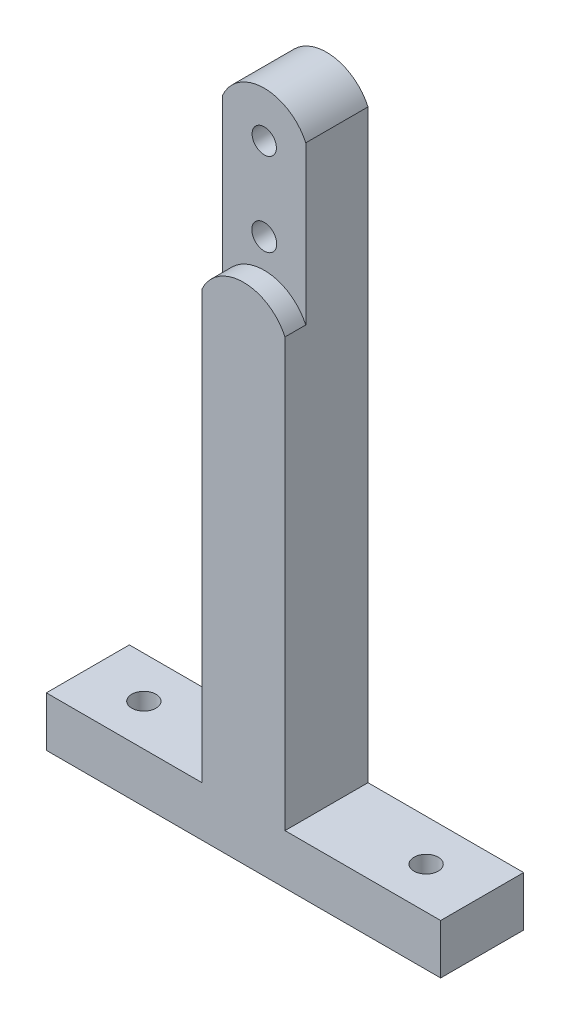
ISO-10303-21;
HEADER;
FILE_DESCRIPTION(('STEP AP214'),'2;1');
FILE_NAME('part.step','',(''),(''),'','','');
FILE_SCHEMA(('AUTOMOTIVE_DESIGN { 1 0 10303 214 1 1 1 1 }'));
ENDSEC;
DATA;
#1=APPLICATION_CONTEXT('core data for automotive mechanical design processes');
#2=APPLICATION_PROTOCOL_DEFINITION('international standard','automotive_design',2000,#1);
#3=PRODUCT_CONTEXT('',#1,'mechanical');
#4=PRODUCT('Part','Part','',(#3));
#5=PRODUCT_RELATED_PRODUCT_CATEGORY('part','',(#4));
#6=PRODUCT_DEFINITION_FORMATION('','',#4);
#7=PRODUCT_DEFINITION_CONTEXT('part definition',#1,'design');
#8=PRODUCT_DEFINITION('design','',#6,#7);
#9=PRODUCT_DEFINITION_SHAPE('','',#8);
#10=(LENGTH_UNIT() NAMED_UNIT(*) SI_UNIT(.MILLI.,.METRE.));
#11=(NAMED_UNIT(*) PLANE_ANGLE_UNIT() SI_UNIT($,.RADIAN.));
#12=(NAMED_UNIT(*) SI_UNIT($,.STERADIAN.) SOLID_ANGLE_UNIT());
#13=UNCERTAINTY_MEASURE_WITH_UNIT(LENGTH_MEASURE(1.E-05),#10,'distance_accuracy_value','');
#14=(GEOMETRIC_REPRESENTATION_CONTEXT(3) GLOBAL_UNCERTAINTY_ASSIGNED_CONTEXT((#13)) GLOBAL_UNIT_ASSIGNED_CONTEXT((#10,
#11,#12)) REPRESENTATION_CONTEXT('',''));
#15=CARTESIAN_POINT('',(0.,0.,0.));
#16=DIRECTION('',(0.,0.,1.));
#17=DIRECTION('',(1.,0.,0.));
#18=AXIS2_PLACEMENT_3D('',#15,#16,#17);
#19=CARTESIAN_POINT('',(0.,-132.83,20.));
#20=DIRECTION('',(0.,0.,-1.));
#21=DIRECTION('',(-1.,0.,0.));
#22=AXIS2_PLACEMENT_3D('',#19,#20,#21);
#23=CYLINDRICAL_SURFACE('',#22,11.);
#24=CARTESIAN_POINT('',(0.,-132.83,15.));
#25=DIRECTION('',(0.,0.,1.));
#26=DIRECTION('',(1.,0.,0.));
#27=AXIS2_PLACEMENT_3D('',#24,#25,#26);
#28=CIRCLE('',#27,11.);
#29=CARTESIAN_POINT('',(10.,-128.247424305044,15.));
#30=VERTEX_POINT('',#29);
#31=CARTESIAN_POINT('',(-10.,-128.247424305044,15.));
#32=VERTEX_POINT('',#31);
#33=EDGE_CURVE('E202',#30,#32,#28,.T.);
#34=ORIENTED_EDGE('',*,*,#33,.F.);
#35=DIRECTION('',(0.,0.,-1.));
#36=VECTOR('',#35,1.);
#37=CARTESIAN_POINT('',(10.,-128.247424305044,20.));
#38=LINE('',#37,#36);
#39=CARTESIAN_POINT('',(10.,-128.247424305044,0.));
#40=VERTEX_POINT('',#39);
#41=EDGE_CURVE('E91',#30,#40,#38,.T.);
#42=ORIENTED_EDGE('',*,*,#41,.T.);
#43=CARTESIAN_POINT('',(0.,-132.83,0.));
#44=DIRECTION('',(0.,0.,1.));
#45=DIRECTION('',(-1.,0.,0.));
#46=AXIS2_PLACEMENT_3D('',#43,#44,#45);
#47=CIRCLE('',#46,11.);
#48=CARTESIAN_POINT('',(-10.,-128.247424305044,0.));
#49=VERTEX_POINT('',#48);
#50=EDGE_CURVE('E140',#40,#49,#47,.T.);
#51=ORIENTED_EDGE('',*,*,#50,.T.);
#52=DIRECTION('',(0.,0.,-1.));
#53=VECTOR('',#52,1.);
#54=CARTESIAN_POINT('',(-10.,-128.247424305044,20.));
#55=LINE('',#54,#53);
#56=EDGE_CURVE('E11',#32,#49,#55,.T.);
#57=ORIENTED_EDGE('',*,*,#56,.F.);
#58=EDGE_LOOP('',(#34,#42,#51,#57));
#59=FACE_BOUND('',#58,.T.);
#60=ADVANCED_FACE('F34',(#59),#23,.T.);
#61=CARTESIAN_POINT('',(0.,-152.83,20.));
#62=DIRECTION('',(0.,0.,-1.));
#63=DIRECTION('',(-1.,0.,0.));
#64=AXIS2_PLACEMENT_3D('',#61,#62,#63);
#65=CYLINDRICAL_SURFACE('',#64,3.);
#66=CARTESIAN_POINT('',(0.,-152.83,0.));
#67=DIRECTION('',(0.,0.,1.));
#68=DIRECTION('',(1.,0.,0.));
#69=AXIS2_PLACEMENT_3D('',#66,#67,#68);
#70=CIRCLE('',#69,3.);
#71=CARTESIAN_POINT('',(3.00000000000001,-152.83,0.));
#72=VERTEX_POINT('',#71);
#73=EDGE_CURVE('E143',#72,#72,#70,.T.);
#74=ORIENTED_EDGE('',*,*,#73,.F.);
#75=EDGE_LOOP('',(#74));
#76=FACE_BOUND('',#75,.T.);
#77=CARTESIAN_POINT('',(0.,-152.83,15.));
#78=DIRECTION('',(0.,0.,1.));
#79=DIRECTION('',(1.,0.,0.));
#80=AXIS2_PLACEMENT_3D('',#77,#78,#79);
#81=CIRCLE('',#80,3.);
#82=CARTESIAN_POINT('',(3.00000000000001,-152.83,15.));
#83=VERTEX_POINT('',#82);
#84=EDGE_CURVE('E189',#83,#83,#81,.T.);
#85=ORIENTED_EDGE('',*,*,#84,.T.);
#86=EDGE_LOOP('',(#85));
#87=FACE_BOUND('',#86,.T.);
#88=ADVANCED_FACE('F240',(#76,#87),#65,.F.);
#89=CARTESIAN_POINT('',(0.,-132.83,20.));
#90=DIRECTION('',(0.,0.,-1.));
#91=DIRECTION('',(-1.,0.,0.));
#92=AXIS2_PLACEMENT_3D('',#89,#90,#91);
#93=CYLINDRICAL_SURFACE('',#92,2.925);
#94=CARTESIAN_POINT('',(0.,-132.83,0.));
#95=DIRECTION('',(0.,0.,1.));
#96=DIRECTION('',(1.,0.,0.));
#97=AXIS2_PLACEMENT_3D('',#94,#95,#96);
#98=CIRCLE('',#97,2.925);
#99=CARTESIAN_POINT('',(2.925,-132.83,0.));
#100=VERTEX_POINT('',#99);
#101=EDGE_CURVE('E186',#100,#100,#98,.T.);
#102=ORIENTED_EDGE('',*,*,#101,.F.);
#103=EDGE_LOOP('',(#102));
#104=FACE_BOUND('',#103,.T.);
#105=CARTESIAN_POINT('',(0.,-132.83,15.));
#106=DIRECTION('',(0.,0.,1.));
#107=DIRECTION('',(1.,0.,0.));
#108=AXIS2_PLACEMENT_3D('',#105,#106,#107);
#109=CIRCLE('',#108,2.925);
#110=CARTESIAN_POINT('',(2.925,-132.83,15.));
#111=VERTEX_POINT('',#110);
#112=EDGE_CURVE('E37',#111,#111,#109,.T.);
#113=ORIENTED_EDGE('',*,*,#112,.T.);
#114=EDGE_LOOP('',(#113));
#115=FACE_BOUND('',#114,.T.);
#116=ADVANCED_FACE('F244',(#104,#115),#93,.F.);
#117=CARTESIAN_POINT('',(0.,-132.83,20.));
#118=DIRECTION('',(0.,0.,-1.));
#119=DIRECTION('',(-1.,0.,0.));
#120=AXIS2_PLACEMENT_3D('',#117,#118,#119);
#121=PLANE('',#120);
#122=DIRECTION('',(0.,1.,0.));
#123=VECTOR('',#122,1.);
#124=CARTESIAN_POINT('',(10.,-128.247424305044,20.));
#125=LINE('',#124,#123);
#126=CARTESIAN_POINT('',(10.,-269.247424305044,20.));
#127=VERTEX_POINT('',#126);
#128=CARTESIAN_POINT('',(10.,-166.247424305044,20.));
#129=VERTEX_POINT('',#128);
#130=EDGE_CURVE('E135',#127,#129,#125,.T.);
#131=ORIENTED_EDGE('',*,*,#130,.T.);
#132=CARTESIAN_POINT('',(0.,-170.83,20.));
#133=DIRECTION('',(0.,0.,-1.));
#134=DIRECTION('',(-1.,0.,0.));
#135=AXIS2_PLACEMENT_3D('',#132,#133,#134);
#136=CIRCLE('',#135,11.);
#137=CARTESIAN_POINT('',(-10.,-166.247424305044,20.));
#138=VERTEX_POINT('',#137);
#139=EDGE_CURVE('E199',#138,#129,#136,.T.);
#140=ORIENTED_EDGE('',*,*,#139,.F.);
#141=DIRECTION('',(0.,-1.,0.));
#142=VECTOR('',#141,1.);
#143=CARTESIAN_POINT('',(-10.,-128.247424305044,20.));
#144=LINE('',#143,#142);
#145=CARTESIAN_POINT('',(-10.,-269.247424305044,20.));
#146=VERTEX_POINT('',#145);
#147=EDGE_CURVE('E99',#138,#146,#144,.T.);
#148=ORIENTED_EDGE('',*,*,#147,.T.);
#149=DIRECTION('',(-1.,0.,0.));
#150=VECTOR('',#149,1.);
#151=CARTESIAN_POINT('',(-47.5,-269.247424305044,20.));
#152=LINE('',#151,#150);
#153=CARTESIAN_POINT('',(-47.5,-269.247424305044,20.));
#154=VERTEX_POINT('',#153);
#155=EDGE_CURVE('E171',#146,#154,#152,.T.);
#156=ORIENTED_EDGE('',*,*,#155,.T.);
#157=DIRECTION('',(0.,-1.,0.));
#158=VECTOR('',#157,1.);
#159=CARTESIAN_POINT('',(-47.5,-269.247424305044,20.));
#160=LINE('',#159,#158);
#161=CARTESIAN_POINT('',(-47.5,-281.247424305044,20.));
#162=VERTEX_POINT('',#161);
#163=EDGE_CURVE('E117',#154,#162,#160,.T.);
#164=ORIENTED_EDGE('',*,*,#163,.T.);
#165=DIRECTION('',(1.,0.,0.));
#166=VECTOR('',#165,1.);
#167=CARTESIAN_POINT('',(-47.5,-281.247424305044,20.));
#168=LINE('',#167,#166);
#169=CARTESIAN_POINT('',(47.5,-281.247424305044,20.));
#170=VERTEX_POINT('',#169);
#171=EDGE_CURVE('E110',#162,#170,#168,.T.);
#172=ORIENTED_EDGE('',*,*,#171,.T.);
#173=DIRECTION('',(0.,1.,0.));
#174=VECTOR('',#173,1.);
#175=CARTESIAN_POINT('',(47.5,-269.247424305044,20.));
#176=LINE('',#175,#174);
#177=CARTESIAN_POINT('',(47.5,-269.247424305044,20.));
#178=VERTEX_POINT('',#177);
#179=EDGE_CURVE('E114',#170,#178,#176,.T.);
#180=ORIENTED_EDGE('',*,*,#179,.T.);
#181=DIRECTION('',(-1.,0.,0.));
#182=VECTOR('',#181,1.);
#183=CARTESIAN_POINT('',(10.,-269.247424305044,20.));
#184=LINE('',#183,#182);
#185=EDGE_CURVE('E58',#178,#127,#184,.T.);
#186=ORIENTED_EDGE('',*,*,#185,.T.);
#187=EDGE_LOOP('',(#131,#140,#148,#156,#164,#172,#180,#186));
#188=FACE_BOUND('',#187,.T.);
#189=ADVANCED_FACE('F112',(#188),#121,.F.);
#190=CARTESIAN_POINT('',(0.,-132.83,0.));
#191=DIRECTION('',(0.,0.,-1.));
#192=DIRECTION('',(-1.,0.,0.));
#193=AXIS2_PLACEMENT_3D('',#190,#191,#192);
#194=PLANE('',#193);
#195=ORIENTED_EDGE('',*,*,#73,.T.);
#196=EDGE_LOOP('',(#195));
#197=FACE_BOUND('',#196,.T.);
#198=ORIENTED_EDGE('',*,*,#50,.F.);
#199=DIRECTION('',(0.,1.,0.));
#200=VECTOR('',#199,1.);
#201=CARTESIAN_POINT('',(10.,-128.247424305044,0.));
#202=LINE('',#201,#200);
#203=CARTESIAN_POINT('',(10.,-269.247424305044,0.));
#204=VERTEX_POINT('',#203);
#205=EDGE_CURVE('E154',#204,#40,#202,.T.);
#206=ORIENTED_EDGE('',*,*,#205,.F.);
#207=DIRECTION('',(-1.,0.,0.));
#208=VECTOR('',#207,1.);
#209=CARTESIAN_POINT('',(10.,-269.247424305044,0.));
#210=LINE('',#209,#208);
#211=CARTESIAN_POINT('',(47.5,-269.247424305044,0.));
#212=VERTEX_POINT('',#211);
#213=EDGE_CURVE('E152',#212,#204,#210,.T.);
#214=ORIENTED_EDGE('',*,*,#213,.F.);
#215=DIRECTION('',(0.,1.,0.));
#216=VECTOR('',#215,1.);
#217=CARTESIAN_POINT('',(47.5,-269.247424305044,0.));
#218=LINE('',#217,#216);
#219=CARTESIAN_POINT('',(47.5,-281.247424305044,0.));
#220=VERTEX_POINT('',#219);
#221=EDGE_CURVE('E150',#220,#212,#218,.T.);
#222=ORIENTED_EDGE('',*,*,#221,.F.);
#223=DIRECTION('',(1.,0.,0.));
#224=VECTOR('',#223,1.);
#225=CARTESIAN_POINT('',(-47.5,-281.247424305044,0.));
#226=LINE('',#225,#224);
#227=CARTESIAN_POINT('',(-47.5,-281.247424305044,0.));
#228=VERTEX_POINT('',#227);
#229=EDGE_CURVE('E126',#228,#220,#226,.T.);
#230=ORIENTED_EDGE('',*,*,#229,.F.);
#231=DIRECTION('',(0.,-1.,0.));
#232=VECTOR('',#231,1.);
#233=CARTESIAN_POINT('',(-47.5,-269.247424305044,0.));
#234=LINE('',#233,#232);
#235=CARTESIAN_POINT('',(-47.5,-269.247424305044,0.));
#236=VERTEX_POINT('',#235);
#237=EDGE_CURVE('E147',#236,#228,#234,.T.);
#238=ORIENTED_EDGE('',*,*,#237,.F.);
#239=DIRECTION('',(-1.,0.,0.));
#240=VECTOR('',#239,1.);
#241=CARTESIAN_POINT('',(-47.5,-269.247424305044,0.));
#242=LINE('',#241,#240);
#243=CARTESIAN_POINT('',(-10.,-269.247424305044,0.));
#244=VERTEX_POINT('',#243);
#245=EDGE_CURVE('E145',#244,#236,#242,.T.);
#246=ORIENTED_EDGE('',*,*,#245,.F.);
#247=DIRECTION('',(0.,-1.,0.));
#248=VECTOR('',#247,1.);
#249=CARTESIAN_POINT('',(-10.,-128.247424305044,0.));
#250=LINE('',#249,#248);
#251=EDGE_CURVE('E142',#49,#244,#250,.T.);
#252=ORIENTED_EDGE('',*,*,#251,.F.);
#253=EDGE_LOOP('',(#198,#206,#214,#222,#230,#238,#246,#252));
#254=FACE_BOUND('',#253,.T.);
#255=ORIENTED_EDGE('',*,*,#101,.T.);
#256=EDGE_LOOP('',(#255));
#257=FACE_BOUND('',#256,.T.);
#258=ADVANCED_FACE('F177',(#197,#254,#257),#194,.T.);
#259=CARTESIAN_POINT('',(-10.,-128.247424305044,20.));
#260=DIRECTION('',(1.,0.,0.));
#261=DIRECTION('',(0.,1.,0.));
#262=AXIS2_PLACEMENT_3D('',#259,#260,#261);
#263=PLANE('',#262);
#264=ORIENTED_EDGE('',*,*,#147,.F.);
#265=DIRECTION('',(0.,0.,1.));
#266=VECTOR('',#265,1.);
#267=CARTESIAN_POINT('',(-10.,-166.247424305044,15.));
#268=LINE('',#267,#266);
#269=CARTESIAN_POINT('',(-10.,-166.247424305044,15.));
#270=VERTEX_POINT('',#269);
#271=EDGE_CURVE('E192',#270,#138,#268,.T.);
#272=ORIENTED_EDGE('',*,*,#271,.F.);
#273=DIRECTION('',(0.,-1.,0.));
#274=VECTOR('',#273,1.);
#275=CARTESIAN_POINT('',(-10.,-128.247424305044,15.));
#276=LINE('',#275,#274);
#277=EDGE_CURVE('E206',#32,#270,#276,.T.);
#278=ORIENTED_EDGE('',*,*,#277,.F.);
#279=ORIENTED_EDGE('',*,*,#56,.T.);
#280=ORIENTED_EDGE('',*,*,#251,.T.);
#281=DIRECTION('',(0.,0.,-1.));
#282=VECTOR('',#281,1.);
#283=CARTESIAN_POINT('',(-10.,-269.247424305044,20.));
#284=LINE('',#283,#282);
#285=EDGE_CURVE('E42',#146,#244,#284,.T.);
#286=ORIENTED_EDGE('',*,*,#285,.F.);
#287=EDGE_LOOP('',(#264,#272,#278,#279,#280,#286));
#288=FACE_BOUND('',#287,.T.);
#289=ADVANCED_FACE('F232',(#288),#263,.F.);
#290=CARTESIAN_POINT('',(-47.5,-269.247424305044,20.));
#291=DIRECTION('',(0.,-1.,0.));
#292=DIRECTION('',(0.,0.,-1.));
#293=AXIS2_PLACEMENT_3D('',#290,#291,#292);
#294=PLANE('',#293);
#295=CARTESIAN_POINT('',(-34.,-269.247424305044,10.));
#296=DIRECTION('',(0.,1.,0.));
#297=DIRECTION('',(0.,0.,1.));
#298=AXIS2_PLACEMENT_3D('',#295,#296,#297);
#299=CIRCLE('',#298,2.925);
#300=CARTESIAN_POINT('',(-34.,-269.247424305044,12.925));
#301=VERTEX_POINT('',#300);
#302=EDGE_CURVE('E216',#301,#301,#299,.T.);
#303=ORIENTED_EDGE('',*,*,#302,.F.);
#304=EDGE_LOOP('',(#303));
#305=FACE_BOUND('',#304,.T.);
#306=ORIENTED_EDGE('',*,*,#245,.T.);
#307=DIRECTION('',(0.,0.,-1.));
#308=VECTOR('',#307,1.);
#309=CARTESIAN_POINT('',(-47.5,-269.247424305044,20.));
#310=LINE('',#309,#308);
#311=EDGE_CURVE('E162',#154,#236,#310,.T.);
#312=ORIENTED_EDGE('',*,*,#311,.F.);
#313=ORIENTED_EDGE('',*,*,#155,.F.);
#314=ORIENTED_EDGE('',*,*,#285,.T.);
#315=EDGE_LOOP('',(#306,#312,#313,#314));
#316=FACE_BOUND('',#315,.T.);
#317=ADVANCED_FACE('F169',(#305,#316),#294,.F.);
#318=CARTESIAN_POINT('',(-47.5,-269.247424305044,20.));
#319=DIRECTION('',(1.,0.,0.));
#320=DIRECTION('',(0.,1.,0.));
#321=AXIS2_PLACEMENT_3D('',#318,#319,#320);
#322=PLANE('',#321);
#323=ORIENTED_EDGE('',*,*,#237,.T.);
#324=DIRECTION('',(0.,0.,-1.));
#325=VECTOR('',#324,1.);
#326=CARTESIAN_POINT('',(-47.5,-281.247424305044,20.));
#327=LINE('',#326,#325);
#328=EDGE_CURVE('E129',#162,#228,#327,.T.);
#329=ORIENTED_EDGE('',*,*,#328,.F.);
#330=ORIENTED_EDGE('',*,*,#163,.F.);
#331=ORIENTED_EDGE('',*,*,#311,.T.);
#332=EDGE_LOOP('',(#323,#329,#330,#331));
#333=FACE_BOUND('',#332,.T.);
#334=ADVANCED_FACE('F180',(#333),#322,.F.);
#335=CARTESIAN_POINT('',(-47.5,-281.247424305044,20.));
#336=DIRECTION('',(0.,1.,0.));
#337=DIRECTION('',(-1.,0.,0.));
#338=AXIS2_PLACEMENT_3D('',#335,#336,#337);
#339=PLANE('',#338);
#340=CARTESIAN_POINT('',(-34.,-281.247424305044,10.));
#341=DIRECTION('',(0.,1.,0.));
#342=DIRECTION('',(0.,0.,1.));
#343=AXIS2_PLACEMENT_3D('',#340,#341,#342);
#344=CIRCLE('',#343,2.925);
#345=CARTESIAN_POINT('',(-34.,-281.247424305044,12.925));
#346=VERTEX_POINT('',#345);
#347=EDGE_CURVE('E203',#346,#346,#344,.T.);
#348=ORIENTED_EDGE('',*,*,#347,.T.);
#349=EDGE_LOOP('',(#348));
#350=FACE_BOUND('',#349,.T.);
#351=CARTESIAN_POINT('',(34.,-281.247424305044,10.));
#352=DIRECTION('',(0.,1.,0.));
#353=DIRECTION('',(0.,0.,1.));
#354=AXIS2_PLACEMENT_3D('',#351,#352,#353);
#355=CIRCLE('',#354,2.925);
#356=CARTESIAN_POINT('',(34.,-281.247424305044,12.925));
#357=VERTEX_POINT('',#356);
#358=EDGE_CURVE('E213',#357,#357,#355,.T.);
#359=ORIENTED_EDGE('',*,*,#358,.T.);
#360=EDGE_LOOP('',(#359));
#361=FACE_BOUND('',#360,.T.);
#362=ORIENTED_EDGE('',*,*,#229,.T.);
#363=DIRECTION('',(0.,0.,-1.));
#364=VECTOR('',#363,1.);
#365=CARTESIAN_POINT('',(47.5,-281.247424305044,20.));
#366=LINE('',#365,#364);
#367=EDGE_CURVE('E123',#170,#220,#366,.T.);
#368=ORIENTED_EDGE('',*,*,#367,.F.);
#369=ORIENTED_EDGE('',*,*,#171,.F.);
#370=ORIENTED_EDGE('',*,*,#328,.T.);
#371=EDGE_LOOP('',(#362,#368,#369,#370));
#372=FACE_BOUND('',#371,.T.);
#373=ADVANCED_FACE('F124',(#350,#361,#372),#339,.F.);
#374=CARTESIAN_POINT('',(47.5,-269.247424305044,20.));
#375=DIRECTION('',(-1.,0.,0.));
#376=DIRECTION('',(0.,-1.,0.));
#377=AXIS2_PLACEMENT_3D('',#374,#375,#376);
#378=PLANE('',#377);
#379=ORIENTED_EDGE('',*,*,#221,.T.);
#380=DIRECTION('',(0.,0.,-1.));
#381=VECTOR('',#380,1.);
#382=CARTESIAN_POINT('',(47.5,-269.247424305044,20.));
#383=LINE('',#382,#381);
#384=EDGE_CURVE('E130',#178,#212,#383,.T.);
#385=ORIENTED_EDGE('',*,*,#384,.F.);
#386=ORIENTED_EDGE('',*,*,#179,.F.);
#387=ORIENTED_EDGE('',*,*,#367,.T.);
#388=EDGE_LOOP('',(#379,#385,#386,#387));
#389=FACE_BOUND('',#388,.T.);
#390=ADVANCED_FACE('F132',(#389),#378,.F.);
#391=CARTESIAN_POINT('',(10.,-269.247424305044,20.));
#392=DIRECTION('',(0.,-1.,0.));
#393=DIRECTION('',(0.,0.,-1.));
#394=AXIS2_PLACEMENT_3D('',#391,#392,#393);
#395=PLANE('',#394);
#396=CARTESIAN_POINT('',(34.,-269.247424305044,10.));
#397=DIRECTION('',(0.,1.,0.));
#398=DIRECTION('',(0.,0.,1.));
#399=AXIS2_PLACEMENT_3D('',#396,#397,#398);
#400=CIRCLE('',#399,2.925);
#401=CARTESIAN_POINT('',(34.,-269.247424305044,12.925));
#402=VERTEX_POINT('',#401);
#403=EDGE_CURVE('E210',#402,#402,#400,.T.);
#404=ORIENTED_EDGE('',*,*,#403,.F.);
#405=EDGE_LOOP('',(#404));
#406=FACE_BOUND('',#405,.T.);
#407=ORIENTED_EDGE('',*,*,#213,.T.);
#408=DIRECTION('',(0.,0.,-1.));
#409=VECTOR('',#408,1.);
#410=CARTESIAN_POINT('',(10.,-269.247424305044,20.));
#411=LINE('',#410,#409);
#412=EDGE_CURVE('E157',#127,#204,#411,.T.);
#413=ORIENTED_EDGE('',*,*,#412,.F.);
#414=ORIENTED_EDGE('',*,*,#185,.F.);
#415=ORIENTED_EDGE('',*,*,#384,.T.);
#416=EDGE_LOOP('',(#407,#413,#414,#415));
#417=FACE_BOUND('',#416,.T.);
#418=ADVANCED_FACE('F259',(#406,#417),#395,.F.);
#419=CARTESIAN_POINT('',(10.,-128.247424305044,20.));
#420=DIRECTION('',(-1.,0.,0.));
#421=DIRECTION('',(0.,-1.,0.));
#422=AXIS2_PLACEMENT_3D('',#419,#420,#421);
#423=PLANE('',#422);
#424=DIRECTION('',(0.,1.,0.));
#425=VECTOR('',#424,1.);
#426=CARTESIAN_POINT('',(10.,-128.247424305044,15.));
#427=LINE('',#426,#425);
#428=CARTESIAN_POINT('',(10.,-166.247424305044,15.));
#429=VERTEX_POINT('',#428);
#430=EDGE_CURVE('E196',#429,#30,#427,.T.);
#431=ORIENTED_EDGE('',*,*,#430,.F.);
#432=DIRECTION('',(0.,0.,1.));
#433=VECTOR('',#432,1.);
#434=CARTESIAN_POINT('',(10.,-166.247424305044,15.));
#435=LINE('',#434,#433);
#436=EDGE_CURVE('E195',#429,#129,#435,.T.);
#437=ORIENTED_EDGE('',*,*,#436,.T.);
#438=ORIENTED_EDGE('',*,*,#130,.F.);
#439=ORIENTED_EDGE('',*,*,#412,.T.);
#440=ORIENTED_EDGE('',*,*,#205,.T.);
#441=ORIENTED_EDGE('',*,*,#41,.F.);
#442=EDGE_LOOP('',(#431,#437,#438,#439,#440,#441));
#443=FACE_BOUND('',#442,.T.);
#444=ADVANCED_FACE('F254',(#443),#423,.F.);
#445=CARTESIAN_POINT('',(0.,-170.83,15.));
#446=DIRECTION('',(0.,0.,1.));
#447=DIRECTION('',(1.,0.,0.));
#448=AXIS2_PLACEMENT_3D('',#445,#446,#447);
#449=CYLINDRICAL_SURFACE('',#448,11.);
#450=ORIENTED_EDGE('',*,*,#139,.T.);
#451=ORIENTED_EDGE('',*,*,#436,.F.);
#452=CARTESIAN_POINT('',(0.,-170.83,15.));
#453=DIRECTION('',(0.,0.,-1.));
#454=DIRECTION('',(-1.,0.,0.));
#455=AXIS2_PLACEMENT_3D('',#452,#453,#454);
#456=CIRCLE('',#455,11.);
#457=EDGE_CURVE('E49',#270,#429,#456,.T.);
#458=ORIENTED_EDGE('',*,*,#457,.F.);
#459=ORIENTED_EDGE('',*,*,#271,.T.);
#460=EDGE_LOOP('',(#450,#451,#458,#459));
#461=FACE_BOUND('',#460,.T.);
#462=ADVANCED_FACE('F265',(#461),#449,.T.);
#463=CARTESIAN_POINT('',(0.,-132.83,15.));
#464=DIRECTION('',(0.,0.,1.));
#465=DIRECTION('',(1.,0.,0.));
#466=AXIS2_PLACEMENT_3D('',#463,#464,#465);
#467=PLANE('',#466);
#468=ORIENTED_EDGE('',*,*,#84,.F.);
#469=EDGE_LOOP('',(#468));
#470=FACE_BOUND('',#469,.T.);
#471=ORIENTED_EDGE('',*,*,#112,.F.);
#472=EDGE_LOOP('',(#471));
#473=FACE_BOUND('',#472,.T.);
#474=ORIENTED_EDGE('',*,*,#33,.T.);
#475=ORIENTED_EDGE('',*,*,#277,.T.);
#476=ORIENTED_EDGE('',*,*,#457,.T.);
#477=ORIENTED_EDGE('',*,*,#430,.T.);
#478=EDGE_LOOP('',(#474,#475,#476,#477));
#479=FACE_BOUND('',#478,.T.);
#480=ADVANCED_FACE('F266',(#470,#473,#479),#467,.T.);
#481=CARTESIAN_POINT('',(34.,-281.247424305044,10.));
#482=DIRECTION('',(0.,1.,0.));
#483=DIRECTION('',(0.,0.,1.));
#484=AXIS2_PLACEMENT_3D('',#481,#482,#483);
#485=CYLINDRICAL_SURFACE('',#484,2.925);
#486=ORIENTED_EDGE('',*,*,#358,.F.);
#487=EDGE_LOOP('',(#486));
#488=FACE_BOUND('',#487,.T.);
#489=ORIENTED_EDGE('',*,*,#403,.T.);
#490=EDGE_LOOP('',(#489));
#491=FACE_BOUND('',#490,.T.);
#492=ADVANCED_FACE('F227',(#488,#491),#485,.F.);
#493=CARTESIAN_POINT('',(-34.,-281.247424305044,10.));
#494=DIRECTION('',(0.,1.,0.));
#495=DIRECTION('',(0.,0.,1.));
#496=AXIS2_PLACEMENT_3D('',#493,#494,#495);
#497=CYLINDRICAL_SURFACE('',#496,2.925);
#498=ORIENTED_EDGE('',*,*,#347,.F.);
#499=EDGE_LOOP('',(#498));
#500=FACE_BOUND('',#499,.T.);
#501=ORIENTED_EDGE('',*,*,#302,.T.);
#502=EDGE_LOOP('',(#501));
#503=FACE_BOUND('',#502,.T.);
#504=ADVANCED_FACE('F224',(#500,#503),#497,.F.);
#505=CLOSED_SHELL('',(#60,#88,#116,#189,#258,#289,#317,#334,#373,#390,#418,#444,#462,#480,#492,#504));
#506=MANIFOLD_SOLID_BREP('B2',#505);
#507=ADVANCED_BREP_SHAPE_REPRESENTATION('',(#18,#506),#14);
#508=SHAPE_DEFINITION_REPRESENTATION(#9,#507);
ENDSEC;
END-ISO-10303-21;
